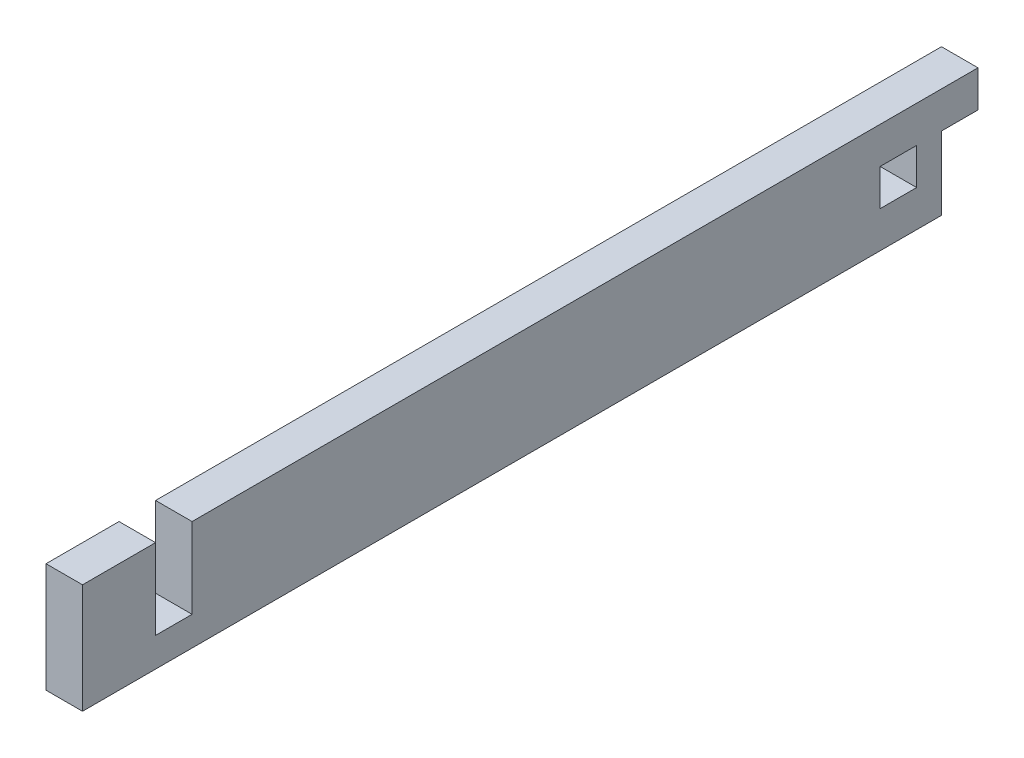
ISO-10303-21;
HEADER;
FILE_DESCRIPTION(('STEP AP214'),'2;1');
FILE_NAME('part.step','',(''),(''),'','','');
FILE_SCHEMA(('AUTOMOTIVE_DESIGN { 1 0 10303 214 1 1 1 1 }'));
ENDSEC;
DATA;
#1=APPLICATION_CONTEXT('core data for automotive mechanical design processes');
#2=APPLICATION_PROTOCOL_DEFINITION('international standard','automotive_design',2000,#1);
#3=PRODUCT_CONTEXT('',#1,'mechanical');
#4=PRODUCT('Part','Part','',(#3));
#5=PRODUCT_RELATED_PRODUCT_CATEGORY('part','',(#4));
#6=PRODUCT_DEFINITION_FORMATION('','',#4);
#7=PRODUCT_DEFINITION_CONTEXT('part definition',#1,'design');
#8=PRODUCT_DEFINITION('design','',#6,#7);
#9=PRODUCT_DEFINITION_SHAPE('','',#8);
#10=(LENGTH_UNIT() NAMED_UNIT(*) SI_UNIT(.MILLI.,.METRE.));
#11=(NAMED_UNIT(*) PLANE_ANGLE_UNIT() SI_UNIT($,.RADIAN.));
#12=(NAMED_UNIT(*) SI_UNIT($,.STERADIAN.) SOLID_ANGLE_UNIT());
#13=UNCERTAINTY_MEASURE_WITH_UNIT(LENGTH_MEASURE(1.E-05),#10,'distance_accuracy_value','');
#14=(GEOMETRIC_REPRESENTATION_CONTEXT(3) GLOBAL_UNCERTAINTY_ASSIGNED_CONTEXT((#13)) GLOBAL_UNIT_ASSIGNED_CONTEXT((#10,
#11,#12)) REPRESENTATION_CONTEXT('',''));
#15=CARTESIAN_POINT('',(0.,0.,0.));
#16=DIRECTION('',(0.,0.,1.));
#17=DIRECTION('',(1.,0.,0.));
#18=AXIS2_PLACEMENT_3D('',#15,#16,#17);
#19=CARTESIAN_POINT('',(0.,19.05,0.));
#20=DIRECTION('',(0.,1.,0.));
#21=DIRECTION('',(0.,0.,1.));
#22=AXIS2_PLACEMENT_3D('',#19,#20,#21);
#23=PLANE('',#22);
#24=DIRECTION('',(0.,0.,1.));
#25=VECTOR('',#24,1.);
#26=CARTESIAN_POINT('',(11.6205,19.05,-66.167));
#27=LINE('',#26,#25);
#28=CARTESIAN_POINT('',(11.6205,19.05,-76.835));
#29=VERTEX_POINT('',#28);
#30=CARTESIAN_POINT('',(11.6205,19.05,59.817));
#31=VERTEX_POINT('',#30);
#32=EDGE_CURVE('E194',#29,#31,#27,.T.);
#33=ORIENTED_EDGE('',*,*,#32,.T.);
#34=DIRECTION('',(-1.,0.,0.));
#35=VECTOR('',#34,1.);
#36=CARTESIAN_POINT('',(17.9705,19.05,59.817));
#37=LINE('',#36,#35);
#38=CARTESIAN_POINT('',(17.9705,19.05,59.817));
#39=VERTEX_POINT('',#38);
#40=EDGE_CURVE('E163',#39,#31,#37,.T.);
#41=ORIENTED_EDGE('',*,*,#40,.F.);
#42=DIRECTION('',(0.,0.,-1.));
#43=VECTOR('',#42,1.);
#44=CARTESIAN_POINT('',(17.9705,19.05,-76.835));
#45=LINE('',#44,#43);
#46=CARTESIAN_POINT('',(17.9705,19.05,-76.835));
#47=VERTEX_POINT('',#46);
#48=EDGE_CURVE('E188',#39,#47,#45,.T.);
#49=ORIENTED_EDGE('',*,*,#48,.T.);
#50=DIRECTION('',(-1.,0.,0.));
#51=VECTOR('',#50,1.);
#52=CARTESIAN_POINT('',(11.6205,19.05,-76.835));
#53=LINE('',#52,#51);
#54=EDGE_CURVE('E192',#47,#29,#53,.T.);
#55=ORIENTED_EDGE('',*,*,#54,.T.);
#56=EDGE_LOOP('',(#33,#41,#49,#55));
#57=FACE_BOUND('',#56,.T.);
#58=ADVANCED_FACE('F36',(#57),#23,.T.);
#59=CARTESIAN_POINT('',(0.,0.,0.));
#60=DIRECTION('',(0.,1.,0.));
#61=DIRECTION('',(0.,0.,1.));
#62=AXIS2_PLACEMENT_3D('',#59,#60,#61);
#63=PLANE('',#62);
#64=DIRECTION('',(0.,0.,1.));
#65=VECTOR('',#64,1.);
#66=CARTESIAN_POINT('',(11.6205,0.,-59.817));
#67=LINE('',#66,#65);
#68=CARTESIAN_POINT('',(11.6205,0.,-70.485));
#69=VERTEX_POINT('',#68);
#70=CARTESIAN_POINT('',(11.6205,0.,78.867));
#71=VERTEX_POINT('',#70);
#72=EDGE_CURVE('E186',#69,#71,#67,.T.);
#73=ORIENTED_EDGE('',*,*,#72,.F.);
#74=DIRECTION('',(-1.,0.,0.));
#75=VECTOR('',#74,1.);
#76=CARTESIAN_POINT('',(17.9705,0.,-70.485));
#77=LINE('',#76,#75);
#78=CARTESIAN_POINT('',(17.9705,0.,-70.485));
#79=VERTEX_POINT('',#78);
#80=EDGE_CURVE('E170',#79,#69,#77,.T.);
#81=ORIENTED_EDGE('',*,*,#80,.F.);
#82=DIRECTION('',(0.,0.,-1.));
#83=VECTOR('',#82,1.);
#84=CARTESIAN_POINT('',(17.9705,0.,-76.835));
#85=LINE('',#84,#83);
#86=CARTESIAN_POINT('',(17.9705,0.,78.867));
#87=VERTEX_POINT('',#86);
#88=EDGE_CURVE('E198',#87,#79,#85,.T.);
#89=ORIENTED_EDGE('',*,*,#88,.F.);
#90=DIRECTION('',(1.,0.,0.));
#91=VECTOR('',#90,1.);
#92=CARTESIAN_POINT('',(17.9705,0.,78.867));
#93=LINE('',#92,#91);
#94=EDGE_CURVE('E182',#71,#87,#93,.T.);
#95=ORIENTED_EDGE('',*,*,#94,.F.);
#96=EDGE_LOOP('',(#73,#81,#89,#95));
#97=FACE_BOUND('',#96,.T.);
#98=ADVANCED_FACE('F238',(#97),#63,.F.);
#99=CARTESIAN_POINT('',(17.9705,5.08,59.817));
#100=DIRECTION('',(0.,-1.,0.));
#101=DIRECTION('',(0.,0.,-1.));
#102=AXIS2_PLACEMENT_3D('',#99,#100,#101);
#103=PLANE('',#102);
#104=DIRECTION('',(0.,0.,-1.));
#105=VECTOR('',#104,1.);
#106=CARTESIAN_POINT('',(11.6205,5.08,59.817));
#107=LINE('',#106,#105);
#108=CARTESIAN_POINT('',(11.6205,5.08,66.167));
#109=VERTEX_POINT('',#108);
#110=CARTESIAN_POINT('',(11.6205,5.08,59.817));
#111=VERTEX_POINT('',#110);
#112=EDGE_CURVE('E251',#109,#111,#107,.T.);
#113=ORIENTED_EDGE('',*,*,#112,.F.);
#114=DIRECTION('',(-1.,0.,0.));
#115=VECTOR('',#114,1.);
#116=CARTESIAN_POINT('',(17.9705,5.08,66.167));
#117=LINE('',#116,#115);
#118=CARTESIAN_POINT('',(17.9705,5.08,66.167));
#119=VERTEX_POINT('',#118);
#120=EDGE_CURVE('E257',#119,#109,#117,.T.);
#121=ORIENTED_EDGE('',*,*,#120,.F.);
#122=DIRECTION('',(0.,0.,1.));
#123=VECTOR('',#122,1.);
#124=CARTESIAN_POINT('',(17.9705,5.08,59.817));
#125=LINE('',#124,#123);
#126=CARTESIAN_POINT('',(17.9705,5.08,59.817));
#127=VERTEX_POINT('',#126);
#128=EDGE_CURVE('E409',#127,#119,#125,.T.);
#129=ORIENTED_EDGE('',*,*,#128,.F.);
#130=DIRECTION('',(-1.,0.,0.));
#131=VECTOR('',#130,1.);
#132=CARTESIAN_POINT('',(17.9705,5.08,59.817));
#133=LINE('',#132,#131);
#134=EDGE_CURVE('E262',#127,#111,#133,.T.);
#135=ORIENTED_EDGE('',*,*,#134,.T.);
#136=EDGE_LOOP('',(#113,#121,#129,#135));
#137=FACE_BOUND('',#136,.T.);
#138=ADVANCED_FACE('F292',(#137),#103,.F.);
#139=CARTESIAN_POINT('',(17.9705,12.7,-66.167));
#140=DIRECTION('',(0.,1.,0.));
#141=DIRECTION('',(0.,0.,1.));
#142=AXIS2_PLACEMENT_3D('',#139,#140,#141);
#143=PLANE('',#142);
#144=DIRECTION('',(0.,0.,1.));
#145=VECTOR('',#144,1.);
#146=CARTESIAN_POINT('',(11.6205,12.7,-66.167));
#147=LINE('',#146,#145);
#148=CARTESIAN_POINT('',(11.6205,12.7,-66.167));
#149=VERTEX_POINT('',#148);
#150=CARTESIAN_POINT('',(11.6205,12.7,-59.817));
#151=VERTEX_POINT('',#150);
#152=EDGE_CURVE('E278',#149,#151,#147,.T.);
#153=ORIENTED_EDGE('',*,*,#152,.F.);
#154=DIRECTION('',(-1.,0.,0.));
#155=VECTOR('',#154,1.);
#156=CARTESIAN_POINT('',(17.9705,12.7,-66.167));
#157=LINE('',#156,#155);
#158=CARTESIAN_POINT('',(17.9705,12.7,-66.167));
#159=VERTEX_POINT('',#158);
#160=EDGE_CURVE('E147',#159,#149,#157,.T.);
#161=ORIENTED_EDGE('',*,*,#160,.F.);
#162=DIRECTION('',(0.,0.,-1.));
#163=VECTOR('',#162,1.);
#164=CARTESIAN_POINT('',(17.9705,12.7,-66.167));
#165=LINE('',#164,#163);
#166=CARTESIAN_POINT('',(17.9705,12.7,-59.817));
#167=VERTEX_POINT('',#166);
#168=EDGE_CURVE('E155',#167,#159,#165,.T.);
#169=ORIENTED_EDGE('',*,*,#168,.F.);
#170=DIRECTION('',(-1.,0.,0.));
#171=VECTOR('',#170,1.);
#172=CARTESIAN_POINT('',(17.9705,12.7,-59.817));
#173=LINE('',#172,#171);
#174=EDGE_CURVE('E157',#167,#151,#173,.T.);
#175=ORIENTED_EDGE('',*,*,#174,.T.);
#176=EDGE_LOOP('',(#153,#161,#169,#175));
#177=FACE_BOUND('',#176,.T.);
#178=ADVANCED_FACE('F277',(#177),#143,.F.);
#179=CARTESIAN_POINT('',(17.9705,6.35,-66.167));
#180=DIRECTION('',(0.,-1.,0.));
#181=DIRECTION('',(0.,0.,-1.));
#182=AXIS2_PLACEMENT_3D('',#179,#180,#181);
#183=PLANE('',#182);
#184=DIRECTION('',(0.,0.,-1.));
#185=VECTOR('',#184,1.);
#186=CARTESIAN_POINT('',(11.6205,6.35,-66.167));
#187=LINE('',#186,#185);
#188=CARTESIAN_POINT('',(11.6205,6.35,-59.817));
#189=VERTEX_POINT('',#188);
#190=CARTESIAN_POINT('',(11.6205,6.35,-66.167));
#191=VERTEX_POINT('',#190);
#192=EDGE_CURVE('E11',#189,#191,#187,.T.);
#193=ORIENTED_EDGE('',*,*,#192,.F.);
#194=DIRECTION('',(-1.,0.,0.));
#195=VECTOR('',#194,1.);
#196=CARTESIAN_POINT('',(17.9705,6.35,-59.817));
#197=LINE('',#196,#195);
#198=CARTESIAN_POINT('',(17.9705,6.35,-59.817));
#199=VERTEX_POINT('',#198);
#200=EDGE_CURVE('E154',#199,#189,#197,.T.);
#201=ORIENTED_EDGE('',*,*,#200,.F.);
#202=DIRECTION('',(0.,0.,1.));
#203=VECTOR('',#202,1.);
#204=CARTESIAN_POINT('',(17.9705,6.35,-66.167));
#205=LINE('',#204,#203);
#206=CARTESIAN_POINT('',(17.9705,6.35,-66.167));
#207=VERTEX_POINT('',#206);
#208=EDGE_CURVE('E152',#207,#199,#205,.T.);
#209=ORIENTED_EDGE('',*,*,#208,.F.);
#210=DIRECTION('',(-1.,0.,0.));
#211=VECTOR('',#210,1.);
#212=CARTESIAN_POINT('',(17.9705,6.35,-66.167));
#213=LINE('',#212,#211);
#214=EDGE_CURVE('E145',#207,#191,#213,.T.);
#215=ORIENTED_EDGE('',*,*,#214,.T.);
#216=EDGE_LOOP('',(#193,#201,#209,#215));
#217=FACE_BOUND('',#216,.T.);
#218=ADVANCED_FACE('F150',(#217),#183,.F.);
#219=CARTESIAN_POINT('',(17.9705,19.05,78.867));
#220=DIRECTION('',(0.,0.,-1.));
#221=DIRECTION('',(-1.,0.,0.));
#222=AXIS2_PLACEMENT_3D('',#219,#220,#221);
#223=PLANE('',#222);
#224=ORIENTED_EDGE('',*,*,#94,.T.);
#225=DIRECTION('',(0.,-1.,0.));
#226=VECTOR('',#225,1.);
#227=CARTESIAN_POINT('',(17.9705,19.05,78.867));
#228=LINE('',#227,#226);
#229=CARTESIAN_POINT('',(17.9705,19.05,78.867));
#230=VERTEX_POINT('',#229);
#231=EDGE_CURVE('E210',#230,#87,#228,.T.);
#232=ORIENTED_EDGE('',*,*,#231,.F.);
#233=DIRECTION('',(1.,0.,0.));
#234=VECTOR('',#233,1.);
#235=CARTESIAN_POINT('',(17.9705,19.05,78.867));
#236=LINE('',#235,#234);
#237=CARTESIAN_POINT('',(11.6205,19.05,78.867));
#238=VERTEX_POINT('',#237);
#239=EDGE_CURVE('E185',#238,#230,#236,.T.);
#240=ORIENTED_EDGE('',*,*,#239,.F.);
#241=DIRECTION('',(0.,-1.,0.));
#242=VECTOR('',#241,1.);
#243=CARTESIAN_POINT('',(11.6205,19.05,78.867));
#244=LINE('',#243,#242);
#245=EDGE_CURVE('E213',#238,#71,#244,.T.);
#246=ORIENTED_EDGE('',*,*,#245,.T.);
#247=EDGE_LOOP('',(#224,#232,#240,#246));
#248=FACE_BOUND('',#247,.T.);
#249=ADVANCED_FACE('F38',(#248),#223,.F.);
#250=CARTESIAN_POINT('',(17.9705,19.05,-76.835));
#251=DIRECTION('',(-1.,0.,0.));
#252=DIRECTION('',(0.,0.,1.));
#253=AXIS2_PLACEMENT_3D('',#250,#251,#252);
#254=PLANE('',#253);
#255=ORIENTED_EDGE('',*,*,#48,.F.);
#256=DIRECTION('',(0.,-1.,0.));
#257=VECTOR('',#256,1.);
#258=CARTESIAN_POINT('',(17.9705,19.05,59.817));
#259=LINE('',#258,#257);
#260=EDGE_CURVE('E273',#39,#127,#259,.T.);
#261=ORIENTED_EDGE('',*,*,#260,.T.);
#262=ORIENTED_EDGE('',*,*,#128,.T.);
#263=DIRECTION('',(0.,1.,0.));
#264=VECTOR('',#263,1.);
#265=CARTESIAN_POINT('',(17.9705,19.05,66.167));
#266=LINE('',#265,#264);
#267=CARTESIAN_POINT('',(17.9705,19.05,66.167));
#268=VERTEX_POINT('',#267);
#269=EDGE_CURVE('E258',#119,#268,#266,.T.);
#270=ORIENTED_EDGE('',*,*,#269,.T.);
#271=EDGE_CURVE('E189',#230,#268,#45,.T.);
#272=ORIENTED_EDGE('',*,*,#271,.F.);
#273=ORIENTED_EDGE('',*,*,#231,.T.);
#274=ORIENTED_EDGE('',*,*,#88,.T.);
#275=DIRECTION('',(0.,1.,0.));
#276=VECTOR('',#275,1.);
#277=CARTESIAN_POINT('',(17.9705,0.,-70.485));
#278=LINE('',#277,#276);
#279=CARTESIAN_POINT('',(17.9705,12.7,-70.485));
#280=VERTEX_POINT('',#279);
#281=EDGE_CURVE('E148',#79,#280,#278,.T.);
#282=ORIENTED_EDGE('',*,*,#281,.T.);
#283=DIRECTION('',(0.,0.,-1.));
#284=VECTOR('',#283,1.);
#285=CARTESIAN_POINT('',(17.9705,12.7,-76.835));
#286=LINE('',#285,#284);
#287=CARTESIAN_POINT('',(17.9705,12.7,-76.835));
#288=VERTEX_POINT('',#287);
#289=EDGE_CURVE('E167',#280,#288,#286,.T.);
#290=ORIENTED_EDGE('',*,*,#289,.T.);
#291=DIRECTION('',(0.,-1.,0.));
#292=VECTOR('',#291,1.);
#293=CARTESIAN_POINT('',(17.9705,19.05,-76.835));
#294=LINE('',#293,#292);
#295=EDGE_CURVE('E207',#47,#288,#294,.T.);
#296=ORIENTED_EDGE('',*,*,#295,.F.);
#297=EDGE_LOOP('',(#255,#261,#262,#270,#272,#273,#274,#282,#290,#296));
#298=FACE_BOUND('',#297,.T.);
#299=ORIENTED_EDGE('',*,*,#168,.T.);
#300=DIRECTION('',(0.,-1.,0.));
#301=VECTOR('',#300,1.);
#302=CARTESIAN_POINT('',(17.9705,12.7,-66.167));
#303=LINE('',#302,#301);
#304=EDGE_CURVE('E269',#159,#207,#303,.T.);
#305=ORIENTED_EDGE('',*,*,#304,.T.);
#306=ORIENTED_EDGE('',*,*,#208,.T.);
#307=DIRECTION('',(0.,1.,0.));
#308=VECTOR('',#307,1.);
#309=CARTESIAN_POINT('',(17.9705,12.7,-59.817));
#310=LINE('',#309,#308);
#311=EDGE_CURVE('E51',#199,#167,#310,.T.);
#312=ORIENTED_EDGE('',*,*,#311,.T.);
#313=EDGE_LOOP('',(#299,#305,#306,#312));
#314=FACE_BOUND('',#313,.T.);
#315=ADVANCED_FACE('F230',(#298,#314),#254,.F.);
#316=CARTESIAN_POINT('',(11.6205,19.05,-76.835));
#317=DIRECTION('',(0.,0.,1.));
#318=DIRECTION('',(1.,0.,0.));
#319=AXIS2_PLACEMENT_3D('',#316,#317,#318);
#320=PLANE('',#319);
#321=ORIENTED_EDGE('',*,*,#295,.T.);
#322=DIRECTION('',(-1.,0.,0.));
#323=VECTOR('',#322,1.);
#324=CARTESIAN_POINT('',(17.9705,12.7,-76.835));
#325=LINE('',#324,#323);
#326=CARTESIAN_POINT('',(11.6205,12.7,-76.835));
#327=VERTEX_POINT('',#326);
#328=EDGE_CURVE('E171',#288,#327,#325,.T.);
#329=ORIENTED_EDGE('',*,*,#328,.T.);
#330=DIRECTION('',(0.,-1.,0.));
#331=VECTOR('',#330,1.);
#332=CARTESIAN_POINT('',(11.6205,19.05,-76.835));
#333=LINE('',#332,#331);
#334=EDGE_CURVE('E204',#29,#327,#333,.T.);
#335=ORIENTED_EDGE('',*,*,#334,.F.);
#336=ORIENTED_EDGE('',*,*,#54,.F.);
#337=EDGE_LOOP('',(#321,#329,#335,#336));
#338=FACE_BOUND('',#337,.T.);
#339=ADVANCED_FACE('F225',(#338),#320,.F.);
#340=CARTESIAN_POINT('',(11.6205,19.05,-59.817));
#341=DIRECTION('',(1.,0.,0.));
#342=DIRECTION('',(0.,0.,-1.));
#343=AXIS2_PLACEMENT_3D('',#340,#341,#342);
#344=PLANE('',#343);
#345=DIRECTION('',(0.,1.,0.));
#346=VECTOR('',#345,1.);
#347=CARTESIAN_POINT('',(11.6205,19.05,-66.167));
#348=LINE('',#347,#346);
#349=EDGE_CURVE('E138',#191,#149,#348,.T.);
#350=ORIENTED_EDGE('',*,*,#349,.T.);
#351=ORIENTED_EDGE('',*,*,#152,.T.);
#352=DIRECTION('',(0.,-1.,0.));
#353=VECTOR('',#352,1.);
#354=CARTESIAN_POINT('',(11.6205,19.05,-59.817));
#355=LINE('',#354,#353);
#356=EDGE_CURVE('E140',#151,#189,#355,.T.);
#357=ORIENTED_EDGE('',*,*,#356,.T.);
#358=ORIENTED_EDGE('',*,*,#192,.T.);
#359=EDGE_LOOP('',(#350,#351,#357,#358));
#360=FACE_BOUND('',#359,.T.);
#361=ORIENTED_EDGE('',*,*,#72,.T.);
#362=ORIENTED_EDGE('',*,*,#245,.F.);
#363=DIRECTION('',(0.,0.,1.));
#364=VECTOR('',#363,1.);
#365=CARTESIAN_POINT('',(11.6205,19.05,66.167));
#366=LINE('',#365,#364);
#367=CARTESIAN_POINT('',(11.6205,19.05,66.167));
#368=VERTEX_POINT('',#367);
#369=EDGE_CURVE('E183',#368,#238,#366,.T.);
#370=ORIENTED_EDGE('',*,*,#369,.F.);
#371=DIRECTION('',(0.,-1.,0.));
#372=VECTOR('',#371,1.);
#373=CARTESIAN_POINT('',(11.6205,19.05,66.167));
#374=LINE('',#373,#372);
#375=EDGE_CURVE('E216',#368,#109,#374,.T.);
#376=ORIENTED_EDGE('',*,*,#375,.T.);
#377=ORIENTED_EDGE('',*,*,#112,.T.);
#378=DIRECTION('',(0.,-1.,0.));
#379=VECTOR('',#378,1.);
#380=CARTESIAN_POINT('',(11.6205,19.05,59.817));
#381=LINE('',#380,#379);
#382=EDGE_CURVE('E196',#31,#111,#381,.T.);
#383=ORIENTED_EDGE('',*,*,#382,.F.);
#384=ORIENTED_EDGE('',*,*,#32,.F.);
#385=ORIENTED_EDGE('',*,*,#334,.T.);
#386=DIRECTION('',(0.,0.,1.));
#387=VECTOR('',#386,1.);
#388=CARTESIAN_POINT('',(11.6205,12.7,-66.167));
#389=LINE('',#388,#387);
#390=CARTESIAN_POINT('',(11.6205,12.7,-70.485));
#391=VERTEX_POINT('',#390);
#392=EDGE_CURVE('E44',#327,#391,#389,.T.);
#393=ORIENTED_EDGE('',*,*,#392,.T.);
#394=DIRECTION('',(0.,-1.,0.));
#395=VECTOR('',#394,1.);
#396=CARTESIAN_POINT('',(11.6205,19.05,-70.485));
#397=LINE('',#396,#395);
#398=EDGE_CURVE('E174',#391,#69,#397,.T.);
#399=ORIENTED_EDGE('',*,*,#398,.T.);
#400=EDGE_LOOP('',(#361,#362,#370,#376,#377,#383,#384,#385,#393,#399));
#401=FACE_BOUND('',#400,.T.);
#402=ADVANCED_FACE('F136',(#360,#401),#344,.F.);
#403=DIRECTION('',(-1.,0.,0.));
#404=VECTOR('',#403,1.);
#405=CARTESIAN_POINT('',(17.9705,19.05,66.167));
#406=LINE('',#405,#404);
#407=EDGE_CURVE('E249',#268,#368,#406,.T.);
#408=ORIENTED_EDGE('',*,*,#407,.T.);
#409=ORIENTED_EDGE('',*,*,#369,.T.);
#410=ORIENTED_EDGE('',*,*,#239,.T.);
#411=ORIENTED_EDGE('',*,*,#271,.T.);
#412=EDGE_LOOP('',(#408,#409,#410,#411));
#413=FACE_BOUND('',#412,.T.);
#414=ADVANCED_FACE('F248',(#413),#23,.T.);
#415=CARTESIAN_POINT('',(17.9705,0.,-70.485));
#416=DIRECTION('',(0.,0.,1.));
#417=DIRECTION('',(1.,0.,0.));
#418=AXIS2_PLACEMENT_3D('',#415,#416,#417);
#419=PLANE('',#418);
#420=DIRECTION('',(-1.,0.,0.));
#421=VECTOR('',#420,1.);
#422=CARTESIAN_POINT('',(17.9705,12.7,-70.485));
#423=LINE('',#422,#421);
#424=EDGE_CURVE('E175',#280,#391,#423,.T.);
#425=ORIENTED_EDGE('',*,*,#424,.F.);
#426=ORIENTED_EDGE('',*,*,#281,.F.);
#427=ORIENTED_EDGE('',*,*,#80,.T.);
#428=ORIENTED_EDGE('',*,*,#398,.F.);
#429=EDGE_LOOP('',(#425,#426,#427,#428));
#430=FACE_BOUND('',#429,.T.);
#431=ADVANCED_FACE('F236',(#430),#419,.F.);
#432=CARTESIAN_POINT('',(17.9705,12.7,-76.835));
#433=DIRECTION('',(0.,1.,0.));
#434=DIRECTION('',(0.,0.,1.));
#435=AXIS2_PLACEMENT_3D('',#432,#433,#434);
#436=PLANE('',#435);
#437=ORIENTED_EDGE('',*,*,#328,.F.);
#438=ORIENTED_EDGE('',*,*,#289,.F.);
#439=ORIENTED_EDGE('',*,*,#424,.T.);
#440=ORIENTED_EDGE('',*,*,#392,.F.);
#441=EDGE_LOOP('',(#437,#438,#439,#440));
#442=FACE_BOUND('',#441,.T.);
#443=ADVANCED_FACE('F222',(#442),#436,.F.);
#444=CARTESIAN_POINT('',(17.9705,19.05,59.817));
#445=DIRECTION('',(0.,0.,-1.));
#446=DIRECTION('',(-1.,0.,0.));
#447=AXIS2_PLACEMENT_3D('',#444,#445,#446);
#448=PLANE('',#447);
#449=ORIENTED_EDGE('',*,*,#134,.F.);
#450=ORIENTED_EDGE('',*,*,#260,.F.);
#451=ORIENTED_EDGE('',*,*,#40,.T.);
#452=ORIENTED_EDGE('',*,*,#382,.T.);
#453=EDGE_LOOP('',(#449,#450,#451,#452));
#454=FACE_BOUND('',#453,.T.);
#455=ADVANCED_FACE('F329',(#454),#448,.F.);
#456=CARTESIAN_POINT('',(17.9705,19.05,66.167));
#457=DIRECTION('',(0.,0.,1.));
#458=DIRECTION('',(1.,0.,0.));
#459=AXIS2_PLACEMENT_3D('',#456,#457,#458);
#460=PLANE('',#459);
#461=ORIENTED_EDGE('',*,*,#407,.F.);
#462=ORIENTED_EDGE('',*,*,#269,.F.);
#463=ORIENTED_EDGE('',*,*,#120,.T.);
#464=ORIENTED_EDGE('',*,*,#375,.F.);
#465=EDGE_LOOP('',(#461,#462,#463,#464));
#466=FACE_BOUND('',#465,.T.);
#467=ADVANCED_FACE('F254',(#466),#460,.F.);
#468=CARTESIAN_POINT('',(17.9705,12.7,-66.167));
#469=DIRECTION('',(0.,0.,-1.));
#470=DIRECTION('',(-1.,0.,0.));
#471=AXIS2_PLACEMENT_3D('',#468,#469,#470);
#472=PLANE('',#471);
#473=ORIENTED_EDGE('',*,*,#214,.F.);
#474=ORIENTED_EDGE('',*,*,#304,.F.);
#475=ORIENTED_EDGE('',*,*,#160,.T.);
#476=ORIENTED_EDGE('',*,*,#349,.F.);
#477=EDGE_LOOP('',(#473,#474,#475,#476));
#478=FACE_BOUND('',#477,.T.);
#479=ADVANCED_FACE('F143',(#478),#472,.F.);
#480=CARTESIAN_POINT('',(17.9705,12.7,-59.817));
#481=DIRECTION('',(0.,0.,1.));
#482=DIRECTION('',(1.,0.,0.));
#483=AXIS2_PLACEMENT_3D('',#480,#481,#482);
#484=PLANE('',#483);
#485=ORIENTED_EDGE('',*,*,#174,.F.);
#486=ORIENTED_EDGE('',*,*,#311,.F.);
#487=ORIENTED_EDGE('',*,*,#200,.T.);
#488=ORIENTED_EDGE('',*,*,#356,.F.);
#489=EDGE_LOOP('',(#485,#486,#487,#488));
#490=FACE_BOUND('',#489,.T.);
#491=ADVANCED_FACE('F279',(#490),#484,.F.);
#492=CLOSED_SHELL('',(#58,#98,#138,#178,#218,#249,#315,#339,#402,#414,#431,#443,#455,#467,#479,#491));
#493=MANIFOLD_SOLID_BREP('B2',#492);
#494=ADVANCED_BREP_SHAPE_REPRESENTATION('',(#18,#493),#14);
#495=SHAPE_DEFINITION_REPRESENTATION(#9,#494);
ENDSEC;
END-ISO-10303-21;
